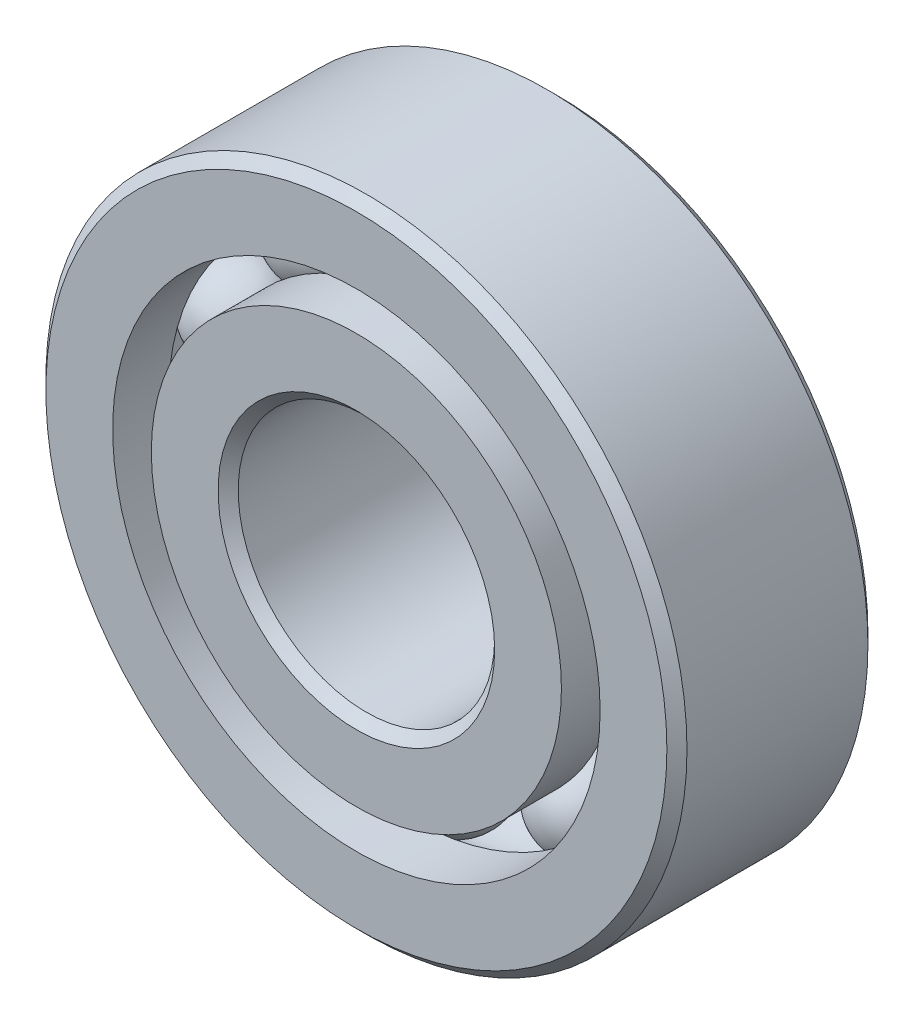
ISO-10303-21;
HEADER;
FILE_DESCRIPTION(('STEP AP214'),'2;1');
FILE_NAME('part.step','',(''),(''),'','','');
FILE_SCHEMA(('AUTOMOTIVE_DESIGN { 1 0 10303 214 1 1 1 1 }'));
ENDSEC;
DATA;
#1=APPLICATION_CONTEXT('core data for automotive mechanical design processes');
#2=APPLICATION_PROTOCOL_DEFINITION('international standard','automotive_design',2000,#1);
#3=PRODUCT_CONTEXT('',#1,'mechanical');
#4=PRODUCT('Part','Part','',(#3));
#5=PRODUCT_RELATED_PRODUCT_CATEGORY('part','',(#4));
#6=PRODUCT_DEFINITION_FORMATION('','',#4);
#7=PRODUCT_DEFINITION_CONTEXT('part definition',#1,'design');
#8=PRODUCT_DEFINITION('design','',#6,#7);
#9=PRODUCT_DEFINITION_SHAPE('','',#8);
#10=(LENGTH_UNIT() NAMED_UNIT(*) SI_UNIT(.MILLI.,.METRE.));
#11=(NAMED_UNIT(*) PLANE_ANGLE_UNIT() SI_UNIT($,.RADIAN.));
#12=(NAMED_UNIT(*) SI_UNIT($,.STERADIAN.) SOLID_ANGLE_UNIT());
#13=UNCERTAINTY_MEASURE_WITH_UNIT(LENGTH_MEASURE(1.E-05),#10,'distance_accuracy_value','');
#14=(GEOMETRIC_REPRESENTATION_CONTEXT(3) GLOBAL_UNCERTAINTY_ASSIGNED_CONTEXT((#13)) GLOBAL_UNIT_ASSIGNED_CONTEXT((#10,
#11,#12)) REPRESENTATION_CONTEXT('',''));
#15=CARTESIAN_POINT('',(0.,0.,0.));
#16=DIRECTION('',(0.,0.,1.));
#17=DIRECTION('',(1.,0.,0.));
#18=AXIS2_PLACEMENT_3D('',#15,#16,#17);
#19=CARTESIAN_POINT('',(-3.26588180804999,4.49510067499584,0.));
#20=DIRECTION('',(0.,0.,1.));
#21=DIRECTION('',(-0.587785252292462,0.809016994374955,0.));
#22=AXIS2_PLACEMENT_3D('',#19,#20,#21);
#23=SPHERICAL_SURFACE('',#22,1.20554465033679);
#24=CARTESIAN_POINT('',(-3.26588180804999,4.49510067499584,1.20554465033679));
#25=VERTEX_POINT('',#24);
#26=VERTEX_LOOP('',#25);
#27=FACE_BOUND('',#26,.T.);
#28=ADVANCED_FACE('F41',(#27),#23,.T.);
#29=CLOSED_SHELL('',(#28));
#30=MANIFOLD_SOLID_BREP('B2',#29);
#31=CARTESIAN_POINT('',(-5.28430776866493,1.71697567499586,0.));
#32=DIRECTION('',(0.,0.,1.));
#33=DIRECTION('',(-0.95105651629515,0.309016994374958,0.));
#34=AXIS2_PLACEMENT_3D('',#31,#32,#33);
#35=SPHERICAL_SURFACE('',#34,1.20554465033679);
#36=CARTESIAN_POINT('',(-5.28430776866493,1.71697567499586,1.20554465033679));
#37=VERTEX_POINT('',#36);
#38=VERTEX_LOOP('',#37);
#39=FACE_BOUND('',#38,.T.);
#40=ADVANCED_FACE('F61',(#39),#35,.T.);
#41=CLOSED_SHELL('',(#40));
#42=MANIFOLD_SOLID_BREP('B6',#41);
#43=CARTESIAN_POINT('',(-5.28430776866496,-1.71697567499575,0.));
#44=DIRECTION('',(0.,0.,1.));
#45=DIRECTION('',(-0.951056516295157,-0.309016994374938,0.));
#46=AXIS2_PLACEMENT_3D('',#43,#44,#45);
#47=SPHERICAL_SURFACE('',#46,1.20554465033679);
#48=CARTESIAN_POINT('',(-5.28430776866496,-1.71697567499575,1.20554465033679));
#49=VERTEX_POINT('',#48);
#50=VERTEX_LOOP('',#49);
#51=FACE_BOUND('',#50,.T.);
#52=ADVANCED_FACE('F81',(#51),#47,.T.);
#53=CLOSED_SHELL('',(#52));
#54=MANIFOLD_SOLID_BREP('B37',#53);
#55=CARTESIAN_POINT('',(-3.26588180805009,-4.49510067499577,0.));
#56=DIRECTION('',(0.,0.,1.));
#57=DIRECTION('',(-0.58778525229248,-0.809016994374942,0.));
#58=AXIS2_PLACEMENT_3D('',#55,#56,#57);
#59=SPHERICAL_SURFACE('',#58,1.20554465033679);
#60=CARTESIAN_POINT('',(-3.26588180805009,-4.49510067499577,1.20554465033679));
#61=VERTEX_POINT('',#60);
#62=VERTEX_LOOP('',#61);
#63=FACE_BOUND('',#62,.T.);
#64=ADVANCED_FACE('F101',(#63),#59,.T.);
#65=CLOSED_SHELL('',(#64));
#66=MANIFOLD_SOLID_BREP('B57',#65);
#67=CARTESIAN_POINT('',(0.,-5.55625,0.));
#68=DIRECTION('',(0.,0.,1.));
#69=DIRECTION('',(0.,-1.,0.));
#70=AXIS2_PLACEMENT_3D('',#67,#68,#69);
#71=SPHERICAL_SURFACE('',#70,1.20554465033679);
#72=CARTESIAN_POINT('',(0.,-5.55625,1.20554465033679));
#73=VERTEX_POINT('',#72);
#74=VERTEX_LOOP('',#73);
#75=FACE_BOUND('',#74,.T.);
#76=ADVANCED_FACE('F121',(#75),#71,.T.);
#77=CLOSED_SHELL('',(#76));
#78=MANIFOLD_SOLID_BREP('B77',#77);
#79=CARTESIAN_POINT('',(3.26588180805003,-4.49510067499582,0.));
#80=DIRECTION('',(0.,0.,1.));
#81=DIRECTION('',(0.587785252292469,-0.809016994374951,0.));
#82=AXIS2_PLACEMENT_3D('',#79,#80,#81);
#83=SPHERICAL_SURFACE('',#82,1.20554465033679);
#84=CARTESIAN_POINT('',(3.26588180805003,-4.49510067499582,1.20554465033679));
#85=VERTEX_POINT('',#84);
#86=VERTEX_LOOP('',#85);
#87=FACE_BOUND('',#86,.T.);
#88=ADVANCED_FACE('F141',(#87),#83,.T.);
#89=CLOSED_SHELL('',(#88));
#90=MANIFOLD_SOLID_BREP('B97',#89);
#91=CARTESIAN_POINT('',(5.28430776866494,-1.71697567499582,0.));
#92=DIRECTION('',(0.,0.,1.));
#93=DIRECTION('',(0.951056516295152,-0.309016994374952,0.));
#94=AXIS2_PLACEMENT_3D('',#91,#92,#93);
#95=SPHERICAL_SURFACE('',#94,1.20554465033679);
#96=CARTESIAN_POINT('',(5.28430776866494,-1.71697567499582,1.20554465033679));
#97=VERTEX_POINT('',#96);
#98=VERTEX_LOOP('',#97);
#99=FACE_BOUND('',#98,.T.);
#100=ADVANCED_FACE('F161',(#99),#95,.T.);
#101=CLOSED_SHELL('',(#100));
#102=MANIFOLD_SOLID_BREP('B117',#101);
#103=CARTESIAN_POINT('',(5.28430776866495,1.71697567499579,0.));
#104=DIRECTION('',(0.,0.,1.));
#105=DIRECTION('',(0.951056516295155,0.309016994374945,0.));
#106=AXIS2_PLACEMENT_3D('',#103,#104,#105);
#107=SPHERICAL_SURFACE('',#106,1.20554465033679);
#108=CARTESIAN_POINT('',(5.28430776866495,1.71697567499579,1.20554465033679));
#109=VERTEX_POINT('',#108);
#110=VERTEX_LOOP('',#109);
#111=FACE_BOUND('',#110,.T.);
#112=ADVANCED_FACE('F181',(#111),#107,.T.);
#113=CLOSED_SHELL('',(#112));
#114=MANIFOLD_SOLID_BREP('B137',#113);
#115=CARTESIAN_POINT('',(3.26588180805006,4.4951006749958,0.));
#116=DIRECTION('',(0.,0.,1.));
#117=DIRECTION('',(0.587785252292474,0.809016994374947,0.));
#118=AXIS2_PLACEMENT_3D('',#115,#116,#117);
#119=SPHERICAL_SURFACE('',#118,1.20554465033679);
#120=CARTESIAN_POINT('',(3.26588180805006,4.4951006749958,1.20554465033679));
#121=VERTEX_POINT('',#120);
#122=VERTEX_LOOP('',#121);
#123=FACE_BOUND('',#122,.T.);
#124=ADVANCED_FACE('F201',(#123),#119,.T.);
#125=CLOSED_SHELL('',(#124));
#126=MANIFOLD_SOLID_BREP('B157',#125);
#127=CARTESIAN_POINT('',(0.,5.55625,0.));
#128=DIRECTION('',(0.,0.,1.));
#129=DIRECTION('',(0.,1.,0.));
#130=AXIS2_PLACEMENT_3D('',#127,#128,#129);
#131=SPHERICAL_SURFACE('',#130,1.20554465033679);
#132=CARTESIAN_POINT('',(0.,5.55625,1.20554465033679));
#133=VERTEX_POINT('',#132);
#134=VERTEX_LOOP('',#133);
#135=FACE_BOUND('',#134,.T.);
#136=ADVANCED_FACE('F224',(#135),#131,.T.);
#137=CLOSED_SHELL('',(#136));
#138=MANIFOLD_SOLID_BREP('B177',#137);
#139=CARTESIAN_POINT('',(0.,5.07727857142858,2.4892));
#140=DIRECTION('',(0.,0.,-1.));
#141=DIRECTION('',(-1.,0.,0.));
#142=AXIS2_PLACEMENT_3D('',#139,#140,#141);
#143=PLANE('',#142);
#144=CARTESIAN_POINT('',(0.,0.,2.4892));
#145=DIRECTION('',(0.,0.,1.));
#146=DIRECTION('',(1.,0.,0.));
#147=AXIS2_PLACEMENT_3D('',#144,#145,#146);
#148=CIRCLE('',#147,3.42392);
#149=CARTESIAN_POINT('',(3.42392,0.,2.4892));
#150=VERTEX_POINT('',#149);
#151=EDGE_CURVE('E272',#150,#150,#148,.T.);
#152=ORIENTED_EDGE('',*,*,#151,.F.);
#153=EDGE_LOOP('',(#152));
#154=FACE_BOUND('',#153,.T.);
#155=CARTESIAN_POINT('',(0.,0.,2.4892));
#156=DIRECTION('',(0.,0.,1.));
#157=DIRECTION('',(1.,0.,0.));
#158=AXIS2_PLACEMENT_3D('',#155,#156,#157);
#159=CIRCLE('',#158,5.07727857142858);
#160=CARTESIAN_POINT('',(5.07727857142858,0.,2.4892));
#161=VERTEX_POINT('',#160);
#162=EDGE_CURVE('E223',#161,#161,#159,.T.);
#163=ORIENTED_EDGE('',*,*,#162,.T.);
#164=EDGE_LOOP('',(#163));
#165=FACE_BOUND('',#164,.T.);
#166=ADVANCED_FACE('F244',(#154,#165),#143,.F.);
#167=CARTESIAN_POINT('',(0.,0.,2.4892));
#168=DIRECTION('',(0.,0.,1.));
#169=DIRECTION('',(1.,0.,0.));
#170=AXIS2_PLACEMENT_3D('',#167,#168,#169);
#171=CYLINDRICAL_SURFACE('',#170,5.07727857142858);
#172=ORIENTED_EDGE('',*,*,#162,.F.);
#173=EDGE_LOOP('',(#172));
#174=FACE_BOUND('',#173,.T.);
#175=CARTESIAN_POINT('',(0.,0.,1.10631111111111));
#176=DIRECTION('',(0.,0.,1.));
#177=DIRECTION('',(1.,0.,0.));
#178=AXIS2_PLACEMENT_3D('',#175,#176,#177);
#179=CIRCLE('',#178,5.07727857142858);
#180=CARTESIAN_POINT('',(5.07727857142858,0.,1.10631111111111));
#181=VERTEX_POINT('',#180);
#182=EDGE_CURVE('E250',#181,#181,#179,.T.);
#183=ORIENTED_EDGE('',*,*,#182,.T.);
#184=EDGE_LOOP('',(#183));
#185=FACE_BOUND('',#184,.T.);
#186=ADVANCED_FACE('F279',(#174,#185),#171,.T.);
#187=CARTESIAN_POINT('',(0.,0.,0.));
#188=DIRECTION('',(0.,0.,1.));
#189=DIRECTION('',(1.,0.,0.));
#190=AXIS2_PLACEMENT_3D('',#187,#188,#189);
#191=TOROIDAL_SURFACE('',#190,5.55625,1.20554465033679);
#192=ORIENTED_EDGE('',*,*,#182,.F.);
#193=EDGE_LOOP('',(#192));
#194=FACE_BOUND('',#193,.T.);
#195=CARTESIAN_POINT('',(0.,0.,-1.10631111111111));
#196=DIRECTION('',(0.,0.,1.));
#197=DIRECTION('',(1.,0.,0.));
#198=AXIS2_PLACEMENT_3D('',#195,#196,#197);
#199=CIRCLE('',#198,5.07727857142858);
#200=CARTESIAN_POINT('',(5.07727857142858,0.,-1.10631111111111));
#201=VERTEX_POINT('',#200);
#202=EDGE_CURVE('E254',#201,#201,#199,.T.);
#203=ORIENTED_EDGE('',*,*,#202,.T.);
#204=EDGE_LOOP('',(#203));
#205=FACE_BOUND('',#204,.T.);
#206=ADVANCED_FACE('F283',(#194,#205),#191,.F.);
#207=CARTESIAN_POINT('',(0.,0.,2.4892));
#208=DIRECTION('',(0.,0.,1.));
#209=DIRECTION('',(1.,0.,0.));
#210=AXIS2_PLACEMENT_3D('',#207,#208,#209);
#211=CYLINDRICAL_SURFACE('',#210,5.07727857142858);
#212=ORIENTED_EDGE('',*,*,#202,.F.);
#213=EDGE_LOOP('',(#212));
#214=FACE_BOUND('',#213,.T.);
#215=CARTESIAN_POINT('',(0.,0.,-2.4892));
#216=DIRECTION('',(0.,0.,1.));
#217=DIRECTION('',(1.,0.,0.));
#218=AXIS2_PLACEMENT_3D('',#215,#216,#217);
#219=CIRCLE('',#218,5.07727857142858);
#220=CARTESIAN_POINT('',(5.07727857142858,0.,-2.4892));
#221=VERTEX_POINT('',#220);
#222=EDGE_CURVE('E258',#221,#221,#219,.T.);
#223=ORIENTED_EDGE('',*,*,#222,.T.);
#224=EDGE_LOOP('',(#223));
#225=FACE_BOUND('',#224,.T.);
#226=ADVANCED_FACE('F288',(#214,#225),#211,.T.);
#227=CARTESIAN_POINT('',(0.,3.42392,-2.4892));
#228=DIRECTION('',(0.,0.,1.));
#229=DIRECTION('',(1.,0.,0.));
#230=AXIS2_PLACEMENT_3D('',#227,#228,#229);
#231=PLANE('',#230);
#232=ORIENTED_EDGE('',*,*,#222,.F.);
#233=EDGE_LOOP('',(#232));
#234=FACE_BOUND('',#233,.T.);
#235=CARTESIAN_POINT('',(0.,0.,-2.4892));
#236=DIRECTION('',(0.,0.,1.));
#237=DIRECTION('',(1.,0.,0.));
#238=AXIS2_PLACEMENT_3D('',#235,#236,#237);
#239=CIRCLE('',#238,3.42392);
#240=CARTESIAN_POINT('',(3.42392,0.,-2.4892));
#241=VERTEX_POINT('',#240);
#242=EDGE_CURVE('E263',#241,#241,#239,.T.);
#243=ORIENTED_EDGE('',*,*,#242,.T.);
#244=EDGE_LOOP('',(#243));
#245=FACE_BOUND('',#244,.T.);
#246=ADVANCED_FACE('F294',(#234,#245),#231,.F.);
#247=CARTESIAN_POINT('',(0.,0.,-2.24028));
#248=DIRECTION('',(0.,0.,-1.));
#249=DIRECTION('',(-1.,0.,0.));
#250=AXIS2_PLACEMENT_3D('',#247,#248,#249);
#251=CONICAL_SURFACE('',#250,3.175,0.785398163397441);
#252=ORIENTED_EDGE('',*,*,#242,.F.);
#253=EDGE_LOOP('',(#252));
#254=FACE_BOUND('',#253,.T.);
#255=CARTESIAN_POINT('',(0.,0.,-2.24028));
#256=DIRECTION('',(0.,0.,1.));
#257=DIRECTION('',(1.,0.,0.));
#258=AXIS2_PLACEMENT_3D('',#255,#256,#257);
#259=CIRCLE('',#258,3.175);
#260=CARTESIAN_POINT('',(3.175,0.,-2.24028));
#261=VERTEX_POINT('',#260);
#262=EDGE_CURVE('E266',#261,#261,#259,.T.);
#263=ORIENTED_EDGE('',*,*,#262,.T.);
#264=EDGE_LOOP('',(#263));
#265=FACE_BOUND('',#264,.T.);
#266=ADVANCED_FACE('F298',(#254,#265),#251,.F.);
#267=CARTESIAN_POINT('',(0.,0.,2.4892));
#268=DIRECTION('',(0.,0.,1.));
#269=DIRECTION('',(1.,0.,0.));
#270=AXIS2_PLACEMENT_3D('',#267,#268,#269);
#271=CYLINDRICAL_SURFACE('',#270,3.175);
#272=ORIENTED_EDGE('',*,*,#262,.F.);
#273=EDGE_LOOP('',(#272));
#274=FACE_BOUND('',#273,.T.);
#275=CARTESIAN_POINT('',(0.,0.,2.24028000000001));
#276=DIRECTION('',(0.,0.,1.));
#277=DIRECTION('',(1.,0.,0.));
#278=AXIS2_PLACEMENT_3D('',#275,#276,#277);
#279=CIRCLE('',#278,3.175);
#280=CARTESIAN_POINT('',(3.175,0.,2.24028000000001));
#281=VERTEX_POINT('',#280);
#282=EDGE_CURVE('E269',#281,#281,#279,.T.);
#283=ORIENTED_EDGE('',*,*,#282,.T.);
#284=EDGE_LOOP('',(#283));
#285=FACE_BOUND('',#284,.T.);
#286=ADVANCED_FACE('F302',(#274,#285),#271,.F.);
#287=CARTESIAN_POINT('',(0.,0.,2.4892));
#288=DIRECTION('',(0.,0.,1.));
#289=DIRECTION('',(1.,0.,0.));
#290=AXIS2_PLACEMENT_3D('',#287,#288,#289);
#291=CONICAL_SURFACE('',#290,3.42392,0.785398163397457);
#292=ORIENTED_EDGE('',*,*,#282,.F.);
#293=EDGE_LOOP('',(#292));
#294=FACE_BOUND('',#293,.T.);
#295=ORIENTED_EDGE('',*,*,#151,.T.);
#296=EDGE_LOOP('',(#295));
#297=FACE_BOUND('',#296,.T.);
#298=ADVANCED_FACE('F276',(#294,#297),#291,.F.);
#299=CLOSED_SHELL('',(#166,#186,#206,#226,#246,#266,#286,#298));
#300=MANIFOLD_SOLID_BREP('B197',#299);
#301=CARTESIAN_POINT('',(0.,0.,2.24028));
#302=DIRECTION('',(0.,0.,-1.));
#303=DIRECTION('',(-1.,0.,0.));
#304=AXIS2_PLACEMENT_3D('',#301,#302,#303);
#305=CONICAL_SURFACE('',#304,7.9375,0.785398163397441);
#306=CARTESIAN_POINT('',(0.,0.,2.4892));
#307=DIRECTION('',(0.,0.,1.));
#308=DIRECTION('',(1.,0.,0.));
#309=AXIS2_PLACEMENT_3D('',#306,#307,#308);
#310=CIRCLE('',#309,7.68858);
#311=CARTESIAN_POINT('',(7.68858,0.,2.4892));
#312=VERTEX_POINT('',#311);
#313=EDGE_CURVE('E394',#312,#312,#310,.T.);
#314=ORIENTED_EDGE('',*,*,#313,.F.);
#315=EDGE_LOOP('',(#314));
#316=FACE_BOUND('',#315,.T.);
#317=CARTESIAN_POINT('',(0.,0.,2.24028));
#318=DIRECTION('',(0.,0.,1.));
#319=DIRECTION('',(1.,0.,0.));
#320=AXIS2_PLACEMENT_3D('',#317,#318,#319);
#321=CIRCLE('',#320,7.9375);
#322=CARTESIAN_POINT('',(7.9375,0.,2.24028));
#323=VERTEX_POINT('',#322);
#324=EDGE_CURVE('E243',#323,#323,#321,.T.);
#325=ORIENTED_EDGE('',*,*,#324,.T.);
#326=EDGE_LOOP('',(#325));
#327=FACE_BOUND('',#326,.T.);
#328=ADVANCED_FACE('F366',(#316,#327),#305,.T.);
#329=CARTESIAN_POINT('',(0.,0.,2.4892));
#330=DIRECTION('',(0.,0.,1.));
#331=DIRECTION('',(1.,0.,0.));
#332=AXIS2_PLACEMENT_3D('',#329,#330,#331);
#333=CYLINDRICAL_SURFACE('',#332,7.9375);
#334=ORIENTED_EDGE('',*,*,#324,.F.);
#335=EDGE_LOOP('',(#334));
#336=FACE_BOUND('',#335,.T.);
#337=CARTESIAN_POINT('',(0.,0.,-2.24028));
#338=DIRECTION('',(0.,0.,1.));
#339=DIRECTION('',(1.,0.,0.));
#340=AXIS2_PLACEMENT_3D('',#337,#338,#339);
#341=CIRCLE('',#340,7.9375);
#342=CARTESIAN_POINT('',(7.9375,0.,-2.24028));
#343=VERTEX_POINT('',#342);
#344=EDGE_CURVE('E372',#343,#343,#341,.T.);
#345=ORIENTED_EDGE('',*,*,#344,.T.);
#346=EDGE_LOOP('',(#345));
#347=FACE_BOUND('',#346,.T.);
#348=ADVANCED_FACE('F401',(#336,#347),#333,.T.);
#349=CARTESIAN_POINT('',(0.,0.,-2.4892));
#350=DIRECTION('',(0.,0.,1.));
#351=DIRECTION('',(1.,0.,0.));
#352=AXIS2_PLACEMENT_3D('',#349,#350,#351);
#353=CONICAL_SURFACE('',#352,7.68858,0.785398163397441);
#354=ORIENTED_EDGE('',*,*,#344,.F.);
#355=EDGE_LOOP('',(#354));
#356=FACE_BOUND('',#355,.T.);
#357=CARTESIAN_POINT('',(0.,0.,-2.4892));
#358=DIRECTION('',(0.,0.,1.));
#359=DIRECTION('',(1.,0.,0.));
#360=AXIS2_PLACEMENT_3D('',#357,#358,#359);
#361=CIRCLE('',#360,7.68858);
#362=CARTESIAN_POINT('',(7.68858,0.,-2.4892));
#363=VERTEX_POINT('',#362);
#364=EDGE_CURVE('E376',#363,#363,#361,.T.);
#365=ORIENTED_EDGE('',*,*,#364,.T.);
#366=EDGE_LOOP('',(#365));
#367=FACE_BOUND('',#366,.T.);
#368=ADVANCED_FACE('F405',(#356,#367),#353,.T.);
#369=CARTESIAN_POINT('',(0.,7.68858,-2.4892));
#370=DIRECTION('',(0.,0.,1.));
#371=DIRECTION('',(1.,0.,0.));
#372=AXIS2_PLACEMENT_3D('',#369,#370,#371);
#373=PLANE('',#372);
#374=ORIENTED_EDGE('',*,*,#364,.F.);
#375=EDGE_LOOP('',(#374));
#376=FACE_BOUND('',#375,.T.);
#377=CARTESIAN_POINT('',(0.,0.,-2.4892));
#378=DIRECTION('',(0.,0.,1.));
#379=DIRECTION('',(1.,0.,0.));
#380=AXIS2_PLACEMENT_3D('',#377,#378,#379);
#381=CIRCLE('',#380,6.03522142857143);
#382=CARTESIAN_POINT('',(6.03522142857143,0.,-2.4892));
#383=VERTEX_POINT('',#382);
#384=EDGE_CURVE('E380',#383,#383,#381,.T.);
#385=ORIENTED_EDGE('',*,*,#384,.T.);
#386=EDGE_LOOP('',(#385));
#387=FACE_BOUND('',#386,.T.);
#388=ADVANCED_FACE('F410',(#376,#387),#373,.F.);
#389=CARTESIAN_POINT('',(0.,0.,2.4892));
#390=DIRECTION('',(0.,0.,1.));
#391=DIRECTION('',(1.,0.,0.));
#392=AXIS2_PLACEMENT_3D('',#389,#390,#391);
#393=CYLINDRICAL_SURFACE('',#392,6.03522142857143);
#394=ORIENTED_EDGE('',*,*,#384,.F.);
#395=EDGE_LOOP('',(#394));
#396=FACE_BOUND('',#395,.T.);
#397=CARTESIAN_POINT('',(0.,0.,-1.10631111111111));
#398=DIRECTION('',(0.,0.,1.));
#399=DIRECTION('',(1.,0.,0.));
#400=AXIS2_PLACEMENT_3D('',#397,#398,#399);
#401=CIRCLE('',#400,6.03522142857143);
#402=CARTESIAN_POINT('',(6.03522142857143,0.,-1.10631111111111));
#403=VERTEX_POINT('',#402);
#404=EDGE_CURVE('E385',#403,#403,#401,.T.);
#405=ORIENTED_EDGE('',*,*,#404,.T.);
#406=EDGE_LOOP('',(#405));
#407=FACE_BOUND('',#406,.T.);
#408=ADVANCED_FACE('F416',(#396,#407),#393,.F.);
#409=CARTESIAN_POINT('',(0.,0.,0.));
#410=DIRECTION('',(0.,0.,1.));
#411=DIRECTION('',(1.,0.,0.));
#412=AXIS2_PLACEMENT_3D('',#409,#410,#411);
#413=TOROIDAL_SURFACE('',#412,5.55625,1.20554465033679);
#414=ORIENTED_EDGE('',*,*,#404,.F.);
#415=EDGE_LOOP('',(#414));
#416=FACE_BOUND('',#415,.T.);
#417=CARTESIAN_POINT('',(0.,0.,1.10631111111111));
#418=DIRECTION('',(0.,0.,1.));
#419=DIRECTION('',(1.,0.,0.));
#420=AXIS2_PLACEMENT_3D('',#417,#418,#419);
#421=CIRCLE('',#420,6.03522142857143);
#422=CARTESIAN_POINT('',(6.03522142857143,0.,1.10631111111111));
#423=VERTEX_POINT('',#422);
#424=EDGE_CURVE('E388',#423,#423,#421,.T.);
#425=ORIENTED_EDGE('',*,*,#424,.T.);
#426=EDGE_LOOP('',(#425));
#427=FACE_BOUND('',#426,.T.);
#428=ADVANCED_FACE('F420',(#416,#427),#413,.F.);
#429=CARTESIAN_POINT('',(0.,0.,2.4892));
#430=DIRECTION('',(0.,0.,1.));
#431=DIRECTION('',(1.,0.,0.));
#432=AXIS2_PLACEMENT_3D('',#429,#430,#431);
#433=CYLINDRICAL_SURFACE('',#432,6.03522142857143);
#434=ORIENTED_EDGE('',*,*,#424,.F.);
#435=EDGE_LOOP('',(#434));
#436=FACE_BOUND('',#435,.T.);
#437=CARTESIAN_POINT('',(0.,0.,2.4892));
#438=DIRECTION('',(0.,0.,1.));
#439=DIRECTION('',(1.,0.,0.));
#440=AXIS2_PLACEMENT_3D('',#437,#438,#439);
#441=CIRCLE('',#440,6.03522142857143);
#442=CARTESIAN_POINT('',(6.03522142857143,0.,2.4892));
#443=VERTEX_POINT('',#442);
#444=EDGE_CURVE('E391',#443,#443,#441,.T.);
#445=ORIENTED_EDGE('',*,*,#444,.T.);
#446=EDGE_LOOP('',(#445));
#447=FACE_BOUND('',#446,.T.);
#448=ADVANCED_FACE('F424',(#436,#447),#433,.F.);
#449=CARTESIAN_POINT('',(0.,7.68858,2.4892));
#450=DIRECTION('',(0.,0.,-1.));
#451=DIRECTION('',(-1.,0.,0.));
#452=AXIS2_PLACEMENT_3D('',#449,#450,#451);
#453=PLANE('',#452);
#454=ORIENTED_EDGE('',*,*,#444,.F.);
#455=EDGE_LOOP('',(#454));
#456=FACE_BOUND('',#455,.T.);
#457=ORIENTED_EDGE('',*,*,#313,.T.);
#458=EDGE_LOOP('',(#457));
#459=FACE_BOUND('',#458,.T.);
#460=ADVANCED_FACE('F398',(#456,#459),#453,.F.);
#461=CLOSED_SHELL('',(#328,#348,#368,#388,#408,#428,#448,#460));
#462=MANIFOLD_SOLID_BREP('B218',#461);
#463=ADVANCED_BREP_SHAPE_REPRESENTATION('',(#18,#30,#42,#54,#66,#78,#90,#102,#114,#126,#138,
#300,#462),#14);
#464=SHAPE_DEFINITION_REPRESENTATION(#9,#463);
ENDSEC;
END-ISO-10303-21;
